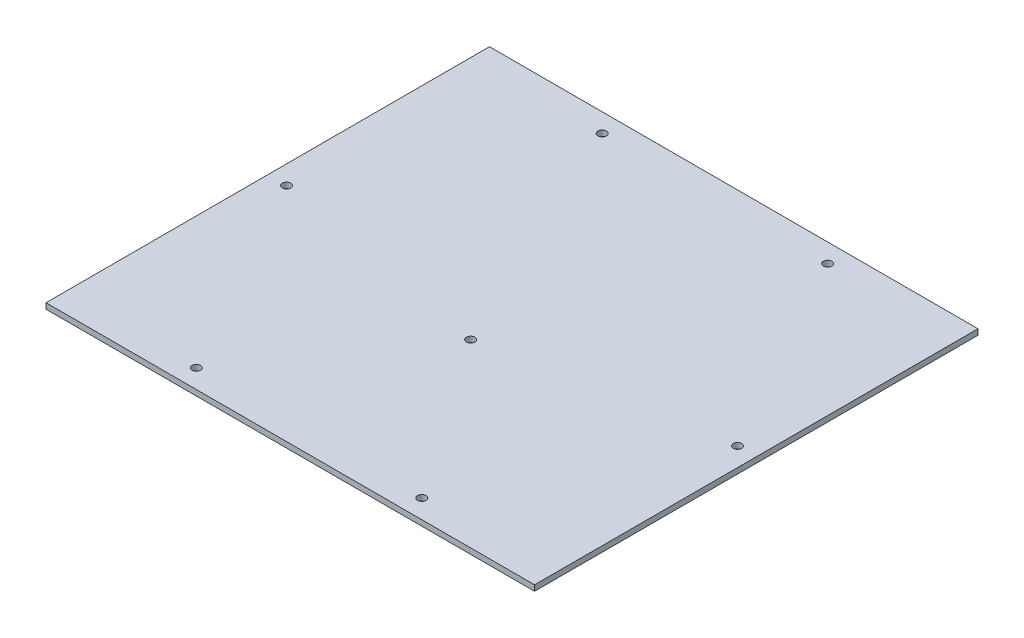
ISO-10303-21;
HEADER;
FILE_DESCRIPTION(('STEP AP214'),'2;1');
FILE_NAME('part.step','',(''),(''),'','','');
FILE_SCHEMA(('AUTOMOTIVE_DESIGN { 1 0 10303 214 1 1 1 1 }'));
ENDSEC;
DATA;
#1=APPLICATION_CONTEXT('core data for automotive mechanical design processes');
#2=APPLICATION_PROTOCOL_DEFINITION('international standard','automotive_design',2000,#1);
#3=PRODUCT_CONTEXT('',#1,'mechanical');
#4=PRODUCT('Part','Part','',(#3));
#5=PRODUCT_RELATED_PRODUCT_CATEGORY('part','',(#4));
#6=PRODUCT_DEFINITION_FORMATION('','',#4);
#7=PRODUCT_DEFINITION_CONTEXT('part definition',#1,'design');
#8=PRODUCT_DEFINITION('design','',#6,#7);
#9=PRODUCT_DEFINITION_SHAPE('','',#8);
#10=(LENGTH_UNIT() NAMED_UNIT(*) SI_UNIT(.MILLI.,.METRE.));
#11=(NAMED_UNIT(*) PLANE_ANGLE_UNIT() SI_UNIT($,.RADIAN.));
#12=(NAMED_UNIT(*) SI_UNIT($,.STERADIAN.) SOLID_ANGLE_UNIT());
#13=UNCERTAINTY_MEASURE_WITH_UNIT(LENGTH_MEASURE(1.E-05),#10,'distance_accuracy_value','');
#14=(GEOMETRIC_REPRESENTATION_CONTEXT(3) GLOBAL_UNCERTAINTY_ASSIGNED_CONTEXT((#13)) GLOBAL_UNIT_ASSIGNED_CONTEXT((#10,
#11,#12)) REPRESENTATION_CONTEXT('',''));
#15=CARTESIAN_POINT('',(0.,0.,0.));
#16=DIRECTION('',(0.,0.,1.));
#17=DIRECTION('',(1.,0.,0.));
#18=AXIS2_PLACEMENT_3D('',#15,#16,#17);
#19=CARTESIAN_POINT('',(0.,3.,0.));
#20=DIRECTION('',(0.,-1.,0.));
#21=DIRECTION('',(0.,0.,-1.));
#22=AXIS2_PLACEMENT_3D('',#19,#20,#21);
#23=PLANE('',#22);
#24=CARTESIAN_POINT('',(130.,3.,-95.9999999999997));
#25=DIRECTION('',(0.,-1.,0.));
#26=DIRECTION('',(0.,0.,-1.));
#27=AXIS2_PLACEMENT_3D('',#24,#25,#26);
#28=CIRCLE('',#27,2.25000000000001);
#29=CARTESIAN_POINT('',(130.,3.,-98.2499999999997));
#30=VERTEX_POINT('',#29);
#31=EDGE_CURVE('E148',#30,#30,#28,.T.);
#32=ORIENTED_EDGE('',*,*,#31,.T.);
#33=EDGE_LOOP('',(#32));
#34=FACE_BOUND('',#33,.T.);
#35=DIRECTION('',(0.,0.,1.));
#36=VECTOR('',#35,1.);
#37=CARTESIAN_POINT('',(0.,3.,0.));
#38=LINE('',#37,#36);
#39=CARTESIAN_POINT('',(0.,3.,-236.));
#40=VERTEX_POINT('',#39);
#41=CARTESIAN_POINT('',(0.,3.,0.));
#42=VERTEX_POINT('',#41);
#43=EDGE_CURVE('E88',#40,#42,#38,.T.);
#44=ORIENTED_EDGE('',*,*,#43,.T.);
#45=DIRECTION('',(1.,0.,0.));
#46=VECTOR('',#45,1.);
#47=CARTESIAN_POINT('',(0.,3.,0.));
#48=LINE('',#47,#46);
#49=CARTESIAN_POINT('',(260.,3.,0.));
#50=VERTEX_POINT('',#49);
#51=EDGE_CURVE('E83',#42,#50,#48,.T.);
#52=ORIENTED_EDGE('',*,*,#51,.T.);
#53=DIRECTION('',(0.,0.,-1.));
#54=VECTOR('',#53,1.);
#55=CARTESIAN_POINT('',(260.,3.,0.));
#56=LINE('',#55,#54);
#57=CARTESIAN_POINT('',(260.,3.,-236.));
#58=VERTEX_POINT('',#57);
#59=EDGE_CURVE('E86',#50,#58,#56,.T.);
#60=ORIENTED_EDGE('',*,*,#59,.T.);
#61=DIRECTION('',(-1.,0.,0.));
#62=VECTOR('',#61,1.);
#63=CARTESIAN_POINT('',(0.,3.,-236.));
#64=LINE('',#63,#62);
#65=EDGE_CURVE('E53',#58,#40,#64,.T.);
#66=ORIENTED_EDGE('',*,*,#65,.T.);
#67=EDGE_LOOP('',(#44,#52,#60,#66));
#68=FACE_BOUND('',#67,.T.);
#69=CARTESIAN_POINT('',(69.9999999999999,3.,-226.));
#70=DIRECTION('',(0.,1.,0.));
#71=DIRECTION('',(0.,0.,1.));
#72=AXIS2_PLACEMENT_3D('',#69,#70,#71);
#73=CIRCLE('',#72,2.25);
#74=CARTESIAN_POINT('',(69.9999999999999,3.,-223.75));
#75=VERTEX_POINT('',#74);
#76=EDGE_CURVE('E103',#75,#75,#73,.T.);
#77=ORIENTED_EDGE('',*,*,#76,.F.);
#78=EDGE_LOOP('',(#77));
#79=FACE_BOUND('',#78,.T.);
#80=CARTESIAN_POINT('',(190.,3.,-226.));
#81=DIRECTION('',(0.,1.,0.));
#82=DIRECTION('',(0.,0.,1.));
#83=AXIS2_PLACEMENT_3D('',#80,#81,#82);
#84=CIRCLE('',#83,2.24999999999995);
#85=CARTESIAN_POINT('',(190.,3.,-223.75));
#86=VERTEX_POINT('',#85);
#87=EDGE_CURVE('E118',#86,#86,#84,.T.);
#88=ORIENTED_EDGE('',*,*,#87,.F.);
#89=EDGE_LOOP('',(#88));
#90=FACE_BOUND('',#89,.T.);
#91=CARTESIAN_POINT('',(9.99999999999996,3.,-118.));
#92=DIRECTION('',(0.,1.,0.));
#93=DIRECTION('',(0.,0.,1.));
#94=AXIS2_PLACEMENT_3D('',#91,#92,#93);
#95=CIRCLE('',#94,2.25);
#96=CARTESIAN_POINT('',(9.99999999999996,3.,-115.75));
#97=VERTEX_POINT('',#96);
#98=EDGE_CURVE('E124',#97,#97,#95,.T.);
#99=ORIENTED_EDGE('',*,*,#98,.F.);
#100=EDGE_LOOP('',(#99));
#101=FACE_BOUND('',#100,.T.);
#102=CARTESIAN_POINT('',(250.,3.,-118.));
#103=DIRECTION('',(0.,1.,0.));
#104=DIRECTION('',(0.,0.,1.));
#105=AXIS2_PLACEMENT_3D('',#102,#103,#104);
#106=CIRCLE('',#105,2.24999999999995);
#107=CARTESIAN_POINT('',(250.,3.,-115.75));
#108=VERTEX_POINT('',#107);
#109=EDGE_CURVE('E130',#108,#108,#106,.T.);
#110=ORIENTED_EDGE('',*,*,#109,.F.);
#111=EDGE_LOOP('',(#110));
#112=FACE_BOUND('',#111,.T.);
#113=CARTESIAN_POINT('',(70.,3.,-10.));
#114=DIRECTION('',(0.,1.,0.));
#115=DIRECTION('',(0.,0.,1.));
#116=AXIS2_PLACEMENT_3D('',#113,#114,#115);
#117=CIRCLE('',#116,2.25);
#118=CARTESIAN_POINT('',(70.,3.,-7.75000000000001));
#119=VERTEX_POINT('',#118);
#120=EDGE_CURVE('E136',#119,#119,#117,.T.);
#121=ORIENTED_EDGE('',*,*,#120,.F.);
#122=EDGE_LOOP('',(#121));
#123=FACE_BOUND('',#122,.T.);
#124=CARTESIAN_POINT('',(190.,3.,-10.));
#125=DIRECTION('',(0.,1.,0.));
#126=DIRECTION('',(0.,0.,1.));
#127=AXIS2_PLACEMENT_3D('',#124,#125,#126);
#128=CIRCLE('',#127,2.24999999999995);
#129=CARTESIAN_POINT('',(190.,3.,-7.75000000000006));
#130=VERTEX_POINT('',#129);
#131=EDGE_CURVE('E142',#130,#130,#128,.T.);
#132=ORIENTED_EDGE('',*,*,#131,.F.);
#133=EDGE_LOOP('',(#132));
#134=FACE_BOUND('',#133,.T.);
#135=ADVANCED_FACE('F36',(#34,#68,#79,#90,#101,#112,#123,#134),#23,.F.);
#136=CARTESIAN_POINT('',(0.,0.,0.));
#137=DIRECTION('',(0.,-1.,0.));
#138=DIRECTION('',(0.,0.,-1.));
#139=AXIS2_PLACEMENT_3D('',#136,#137,#138);
#140=PLANE('',#139);
#141=CARTESIAN_POINT('',(130.,0.,-95.9999999999997));
#142=DIRECTION('',(0.,-1.,0.));
#143=DIRECTION('',(0.,0.,-1.));
#144=AXIS2_PLACEMENT_3D('',#141,#142,#143);
#145=CIRCLE('',#144,2.25000000000001);
#146=CARTESIAN_POINT('',(130.,0.,-98.2499999999997));
#147=VERTEX_POINT('',#146);
#148=EDGE_CURVE('E151',#147,#147,#145,.T.);
#149=ORIENTED_EDGE('',*,*,#148,.F.);
#150=EDGE_LOOP('',(#149));
#151=FACE_BOUND('',#150,.T.);
#152=CARTESIAN_POINT('',(70.,0.,-10.));
#153=DIRECTION('',(0.,1.,0.));
#154=DIRECTION('',(0.,0.,1.));
#155=AXIS2_PLACEMENT_3D('',#152,#153,#154);
#156=CIRCLE('',#155,2.25);
#157=CARTESIAN_POINT('',(70.,0.,-7.75000000000001));
#158=VERTEX_POINT('',#157);
#159=EDGE_CURVE('E139',#158,#158,#156,.T.);
#160=ORIENTED_EDGE('',*,*,#159,.T.);
#161=EDGE_LOOP('',(#160));
#162=FACE_BOUND('',#161,.T.);
#163=CARTESIAN_POINT('',(9.99999999999996,0.,-118.));
#164=DIRECTION('',(0.,1.,0.));
#165=DIRECTION('',(0.,0.,1.));
#166=AXIS2_PLACEMENT_3D('',#163,#164,#165);
#167=CIRCLE('',#166,2.25);
#168=CARTESIAN_POINT('',(9.99999999999996,0.,-115.75));
#169=VERTEX_POINT('',#168);
#170=EDGE_CURVE('E127',#169,#169,#167,.T.);
#171=ORIENTED_EDGE('',*,*,#170,.T.);
#172=EDGE_LOOP('',(#171));
#173=FACE_BOUND('',#172,.T.);
#174=CARTESIAN_POINT('',(69.9999999999999,0.,-226.));
#175=DIRECTION('',(0.,1.,0.));
#176=DIRECTION('',(0.,0.,1.));
#177=AXIS2_PLACEMENT_3D('',#174,#175,#176);
#178=CIRCLE('',#177,2.25);
#179=CARTESIAN_POINT('',(69.9999999999999,0.,-223.75));
#180=VERTEX_POINT('',#179);
#181=EDGE_CURVE('E115',#180,#180,#178,.T.);
#182=ORIENTED_EDGE('',*,*,#181,.T.);
#183=EDGE_LOOP('',(#182));
#184=FACE_BOUND('',#183,.T.);
#185=DIRECTION('',(0.,0.,1.));
#186=VECTOR('',#185,1.);
#187=CARTESIAN_POINT('',(0.,0.,0.));
#188=LINE('',#187,#186);
#189=CARTESIAN_POINT('',(0.,0.,-236.));
#190=VERTEX_POINT('',#189);
#191=CARTESIAN_POINT('',(0.,0.,0.));
#192=VERTEX_POINT('',#191);
#193=EDGE_CURVE('E100',#190,#192,#188,.T.);
#194=ORIENTED_EDGE('',*,*,#193,.F.);
#195=DIRECTION('',(-1.,0.,0.));
#196=VECTOR('',#195,1.);
#197=CARTESIAN_POINT('',(0.,0.,-236.));
#198=LINE('',#197,#196);
#199=CARTESIAN_POINT('',(260.,0.,-236.));
#200=VERTEX_POINT('',#199);
#201=EDGE_CURVE('E76',#200,#190,#198,.T.);
#202=ORIENTED_EDGE('',*,*,#201,.F.);
#203=DIRECTION('',(0.,0.,-1.));
#204=VECTOR('',#203,1.);
#205=CARTESIAN_POINT('',(260.,0.,0.));
#206=LINE('',#205,#204);
#207=CARTESIAN_POINT('',(260.,0.,0.));
#208=VERTEX_POINT('',#207);
#209=EDGE_CURVE('E70',#208,#200,#206,.T.);
#210=ORIENTED_EDGE('',*,*,#209,.F.);
#211=DIRECTION('',(1.,0.,0.));
#212=VECTOR('',#211,1.);
#213=CARTESIAN_POINT('',(0.,0.,0.));
#214=LINE('',#213,#212);
#215=EDGE_CURVE('E92',#192,#208,#214,.T.);
#216=ORIENTED_EDGE('',*,*,#215,.F.);
#217=EDGE_LOOP('',(#194,#202,#210,#216));
#218=FACE_BOUND('',#217,.T.);
#219=CARTESIAN_POINT('',(190.,0.,-226.));
#220=DIRECTION('',(0.,1.,0.));
#221=DIRECTION('',(0.,0.,1.));
#222=AXIS2_PLACEMENT_3D('',#219,#220,#221);
#223=CIRCLE('',#222,2.24999999999995);
#224=CARTESIAN_POINT('',(190.,0.,-223.75));
#225=VERTEX_POINT('',#224);
#226=EDGE_CURVE('E121',#225,#225,#223,.T.);
#227=ORIENTED_EDGE('',*,*,#226,.T.);
#228=EDGE_LOOP('',(#227));
#229=FACE_BOUND('',#228,.T.);
#230=CARTESIAN_POINT('',(250.,0.,-118.));
#231=DIRECTION('',(0.,1.,0.));
#232=DIRECTION('',(0.,0.,1.));
#233=AXIS2_PLACEMENT_3D('',#230,#231,#232);
#234=CIRCLE('',#233,2.24999999999995);
#235=CARTESIAN_POINT('',(250.,0.,-115.75));
#236=VERTEX_POINT('',#235);
#237=EDGE_CURVE('E133',#236,#236,#234,.T.);
#238=ORIENTED_EDGE('',*,*,#237,.T.);
#239=EDGE_LOOP('',(#238));
#240=FACE_BOUND('',#239,.T.);
#241=CARTESIAN_POINT('',(190.,0.,-10.));
#242=DIRECTION('',(0.,1.,0.));
#243=DIRECTION('',(0.,0.,1.));
#244=AXIS2_PLACEMENT_3D('',#241,#242,#243);
#245=CIRCLE('',#244,2.24999999999995);
#246=CARTESIAN_POINT('',(190.,0.,-7.75000000000006));
#247=VERTEX_POINT('',#246);
#248=EDGE_CURVE('E145',#247,#247,#245,.T.);
#249=ORIENTED_EDGE('',*,*,#248,.T.);
#250=EDGE_LOOP('',(#249));
#251=FACE_BOUND('',#250,.T.);
#252=ADVANCED_FACE('F111',(#151,#162,#173,#184,#218,#229,#240,#251),#140,.T.);
#253=CARTESIAN_POINT('',(0.,3.,0.));
#254=DIRECTION('',(1.,0.,0.));
#255=DIRECTION('',(0.,0.,-1.));
#256=AXIS2_PLACEMENT_3D('',#253,#254,#255);
#257=PLANE('',#256);
#258=ORIENTED_EDGE('',*,*,#193,.T.);
#259=DIRECTION('',(0.,-1.,0.));
#260=VECTOR('',#259,1.);
#261=CARTESIAN_POINT('',(0.,3.,0.));
#262=LINE('',#261,#260);
#263=EDGE_CURVE('E11',#42,#192,#262,.T.);
#264=ORIENTED_EDGE('',*,*,#263,.F.);
#265=ORIENTED_EDGE('',*,*,#43,.F.);
#266=DIRECTION('',(0.,-1.,0.));
#267=VECTOR('',#266,1.);
#268=CARTESIAN_POINT('',(0.,3.,-236.));
#269=LINE('',#268,#267);
#270=EDGE_CURVE('E96',#40,#190,#269,.T.);
#271=ORIENTED_EDGE('',*,*,#270,.T.);
#272=EDGE_LOOP('',(#258,#264,#265,#271));
#273=FACE_BOUND('',#272,.T.);
#274=ADVANCED_FACE('F38',(#273),#257,.F.);
#275=CARTESIAN_POINT('',(0.,3.,0.));
#276=DIRECTION('',(0.,0.,-1.));
#277=DIRECTION('',(-1.,0.,0.));
#278=AXIS2_PLACEMENT_3D('',#275,#276,#277);
#279=PLANE('',#278);
#280=ORIENTED_EDGE('',*,*,#215,.T.);
#281=DIRECTION('',(0.,-1.,0.));
#282=VECTOR('',#281,1.);
#283=CARTESIAN_POINT('',(260.,3.,0.));
#284=LINE('',#283,#282);
#285=EDGE_CURVE('E45',#50,#208,#284,.T.);
#286=ORIENTED_EDGE('',*,*,#285,.F.);
#287=ORIENTED_EDGE('',*,*,#51,.F.);
#288=ORIENTED_EDGE('',*,*,#263,.T.);
#289=EDGE_LOOP('',(#280,#286,#287,#288));
#290=FACE_BOUND('',#289,.T.);
#291=ADVANCED_FACE('F91',(#290),#279,.F.);
#292=CARTESIAN_POINT('',(260.,3.,0.));
#293=DIRECTION('',(-1.,0.,0.));
#294=DIRECTION('',(0.,0.,1.));
#295=AXIS2_PLACEMENT_3D('',#292,#293,#294);
#296=PLANE('',#295);
#297=ORIENTED_EDGE('',*,*,#209,.T.);
#298=DIRECTION('',(0.,-1.,0.));
#299=VECTOR('',#298,1.);
#300=CARTESIAN_POINT('',(260.,3.,-236.));
#301=LINE('',#300,#299);
#302=EDGE_CURVE('E93',#58,#200,#301,.T.);
#303=ORIENTED_EDGE('',*,*,#302,.F.);
#304=ORIENTED_EDGE('',*,*,#59,.F.);
#305=ORIENTED_EDGE('',*,*,#285,.T.);
#306=EDGE_LOOP('',(#297,#303,#304,#305));
#307=FACE_BOUND('',#306,.T.);
#308=ADVANCED_FACE('F94',(#307),#296,.F.);
#309=CARTESIAN_POINT('',(0.,3.,-236.));
#310=DIRECTION('',(0.,0.,1.));
#311=DIRECTION('',(1.,0.,0.));
#312=AXIS2_PLACEMENT_3D('',#309,#310,#311);
#313=PLANE('',#312);
#314=ORIENTED_EDGE('',*,*,#201,.T.);
#315=ORIENTED_EDGE('',*,*,#270,.F.);
#316=ORIENTED_EDGE('',*,*,#65,.F.);
#317=ORIENTED_EDGE('',*,*,#302,.T.);
#318=EDGE_LOOP('',(#314,#315,#316,#317));
#319=FACE_BOUND('',#318,.T.);
#320=ADVANCED_FACE('F108',(#319),#313,.F.);
#321=CARTESIAN_POINT('',(69.9999999999999,3.,-226.));
#322=DIRECTION('',(0.,-1.,0.));
#323=DIRECTION('',(0.,0.,-1.));
#324=AXIS2_PLACEMENT_3D('',#321,#322,#323);
#325=CYLINDRICAL_SURFACE('',#324,2.25);
#326=ORIENTED_EDGE('',*,*,#76,.T.);
#327=EDGE_LOOP('',(#326));
#328=FACE_BOUND('',#327,.T.);
#329=ORIENTED_EDGE('',*,*,#181,.F.);
#330=EDGE_LOOP('',(#329));
#331=FACE_BOUND('',#330,.T.);
#332=ADVANCED_FACE('F174',(#328,#331),#325,.F.);
#333=CARTESIAN_POINT('',(190.,3.,-226.));
#334=DIRECTION('',(0.,-1.,0.));
#335=DIRECTION('',(0.,0.,-1.));
#336=AXIS2_PLACEMENT_3D('',#333,#334,#335);
#337=CYLINDRICAL_SURFACE('',#336,2.24999999999995);
#338=ORIENTED_EDGE('',*,*,#87,.T.);
#339=EDGE_LOOP('',(#338));
#340=FACE_BOUND('',#339,.T.);
#341=ORIENTED_EDGE('',*,*,#226,.F.);
#342=EDGE_LOOP('',(#341));
#343=FACE_BOUND('',#342,.T.);
#344=ADVANCED_FACE('F176',(#340,#343),#337,.F.);
#345=CARTESIAN_POINT('',(9.99999999999996,3.,-118.));
#346=DIRECTION('',(0.,-1.,0.));
#347=DIRECTION('',(0.,0.,-1.));
#348=AXIS2_PLACEMENT_3D('',#345,#346,#347);
#349=CYLINDRICAL_SURFACE('',#348,2.25);
#350=ORIENTED_EDGE('',*,*,#98,.T.);
#351=EDGE_LOOP('',(#350));
#352=FACE_BOUND('',#351,.T.);
#353=ORIENTED_EDGE('',*,*,#170,.F.);
#354=EDGE_LOOP('',(#353));
#355=FACE_BOUND('',#354,.T.);
#356=ADVANCED_FACE('F183',(#352,#355),#349,.F.);
#357=CARTESIAN_POINT('',(250.,3.,-118.));
#358=DIRECTION('',(0.,-1.,0.));
#359=DIRECTION('',(0.,0.,-1.));
#360=AXIS2_PLACEMENT_3D('',#357,#358,#359);
#361=CYLINDRICAL_SURFACE('',#360,2.24999999999995);
#362=ORIENTED_EDGE('',*,*,#109,.T.);
#363=EDGE_LOOP('',(#362));
#364=FACE_BOUND('',#363,.T.);
#365=ORIENTED_EDGE('',*,*,#237,.F.);
#366=EDGE_LOOP('',(#365));
#367=FACE_BOUND('',#366,.T.);
#368=ADVANCED_FACE('F229',(#364,#367),#361,.F.);
#369=CARTESIAN_POINT('',(70.,3.,-10.));
#370=DIRECTION('',(0.,-1.,0.));
#371=DIRECTION('',(0.,0.,-1.));
#372=AXIS2_PLACEMENT_3D('',#369,#370,#371);
#373=CYLINDRICAL_SURFACE('',#372,2.25);
#374=ORIENTED_EDGE('',*,*,#120,.T.);
#375=EDGE_LOOP('',(#374));
#376=FACE_BOUND('',#375,.T.);
#377=ORIENTED_EDGE('',*,*,#159,.F.);
#378=EDGE_LOOP('',(#377));
#379=FACE_BOUND('',#378,.T.);
#380=ADVANCED_FACE('F222',(#376,#379),#373,.F.);
#381=CARTESIAN_POINT('',(190.,3.,-10.));
#382=DIRECTION('',(0.,-1.,0.));
#383=DIRECTION('',(0.,0.,-1.));
#384=AXIS2_PLACEMENT_3D('',#381,#382,#383);
#385=CYLINDRICAL_SURFACE('',#384,2.24999999999995);
#386=ORIENTED_EDGE('',*,*,#131,.T.);
#387=EDGE_LOOP('',(#386));
#388=FACE_BOUND('',#387,.T.);
#389=ORIENTED_EDGE('',*,*,#248,.F.);
#390=EDGE_LOOP('',(#389));
#391=FACE_BOUND('',#390,.T.);
#392=ADVANCED_FACE('F161',(#388,#391),#385,.F.);
#393=CARTESIAN_POINT('',(130.,3.,-95.9999999999997));
#394=DIRECTION('',(0.,-1.,0.));
#395=DIRECTION('',(0.,0.,-1.));
#396=AXIS2_PLACEMENT_3D('',#393,#394,#395);
#397=CYLINDRICAL_SURFACE('',#396,2.25000000000001);
#398=ORIENTED_EDGE('',*,*,#31,.F.);
#399=EDGE_LOOP('',(#398));
#400=FACE_BOUND('',#399,.T.);
#401=ORIENTED_EDGE('',*,*,#148,.T.);
#402=EDGE_LOOP('',(#401));
#403=FACE_BOUND('',#402,.T.);
#404=ADVANCED_FACE('F158',(#400,#403),#397,.F.);
#405=CLOSED_SHELL('',(#135,#252,#274,#291,#308,#320,#332,#344,#356,#368,#380,#392,#404));
#406=MANIFOLD_SOLID_BREP('B2',#405);
#407=ADVANCED_BREP_SHAPE_REPRESENTATION('',(#18,#406),#14);
#408=SHAPE_DEFINITION_REPRESENTATION(#9,#407);
ENDSEC;
END-ISO-10303-21;
